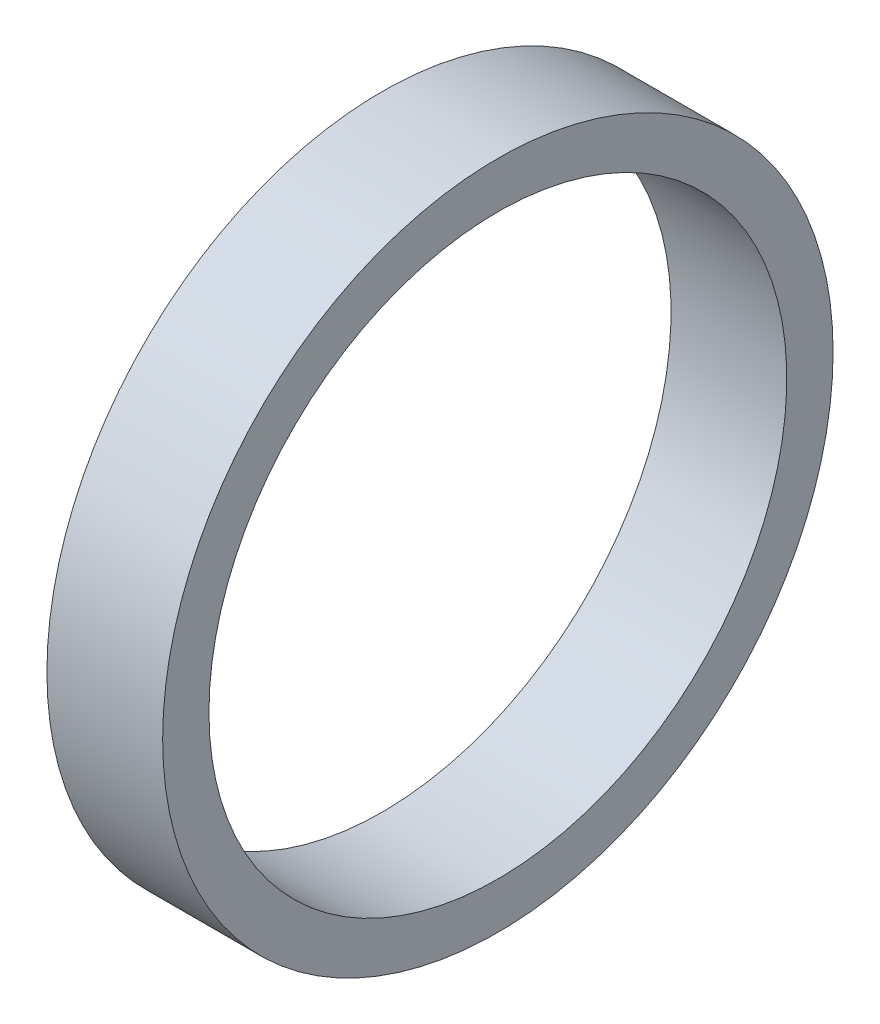
ISO-10303-21;
HEADER;
FILE_DESCRIPTION(('STEP AP214'),'2;1');
FILE_NAME('part.step','',(''),(''),'','','');
FILE_SCHEMA(('AUTOMOTIVE_DESIGN { 1 0 10303 214 1 1 1 1 }'));
ENDSEC;
DATA;
#1=APPLICATION_CONTEXT('core data for automotive mechanical design processes');
#2=APPLICATION_PROTOCOL_DEFINITION('international standard','automotive_design',2000,#1);
#3=PRODUCT_CONTEXT('',#1,'mechanical');
#4=PRODUCT('Part','Part','',(#3));
#5=PRODUCT_RELATED_PRODUCT_CATEGORY('part','',(#4));
#6=PRODUCT_DEFINITION_FORMATION('','',#4);
#7=PRODUCT_DEFINITION_CONTEXT('part definition',#1,'design');
#8=PRODUCT_DEFINITION('design','',#6,#7);
#9=PRODUCT_DEFINITION_SHAPE('','',#8);
#10=(LENGTH_UNIT() NAMED_UNIT(*) SI_UNIT(.MILLI.,.METRE.));
#11=(NAMED_UNIT(*) PLANE_ANGLE_UNIT() SI_UNIT($,.RADIAN.));
#12=(NAMED_UNIT(*) SI_UNIT($,.STERADIAN.) SOLID_ANGLE_UNIT());
#13=UNCERTAINTY_MEASURE_WITH_UNIT(LENGTH_MEASURE(1.E-05),#10,'distance_accuracy_value','');
#14=(GEOMETRIC_REPRESENTATION_CONTEXT(3) GLOBAL_UNCERTAINTY_ASSIGNED_CONTEXT((#13)) GLOBAL_UNIT_ASSIGNED_CONTEXT((#10,
#11,#12)) REPRESENTATION_CONTEXT('',''));
#15=CARTESIAN_POINT('',(0.,0.,0.));
#16=DIRECTION('',(0.,0.,1.));
#17=DIRECTION('',(1.,0.,0.));
#18=AXIS2_PLACEMENT_3D('',#15,#16,#17);
#19=CARTESIAN_POINT('',(14.375,0.,0.));
#20=DIRECTION('',(1.,0.,0.));
#21=DIRECTION('',(0.,0.,-1.));
#22=AXIS2_PLACEMENT_3D('',#19,#20,#21);
#23=PLANE('',#22);
#24=CARTESIAN_POINT('',(14.375,0.,0.));
#25=DIRECTION('',(1.,0.,0.));
#26=DIRECTION('',(0.,0.,-1.));
#27=AXIS2_PLACEMENT_3D('',#24,#25,#26);
#28=CIRCLE('',#27,9.775);
#29=CARTESIAN_POINT('',(14.375,0.,-9.775));
#30=VERTEX_POINT('',#29);
#31=EDGE_CURVE('E11',#30,#30,#28,.T.);
#32=ORIENTED_EDGE('',*,*,#31,.T.);
#33=EDGE_LOOP('',(#32));
#34=FACE_BOUND('',#33,.T.);
#35=CARTESIAN_POINT('',(14.375,0.,0.));
#36=DIRECTION('',(-1.,0.,0.));
#37=DIRECTION('',(0.,0.,-1.));
#38=AXIS2_PLACEMENT_3D('',#35,#36,#37);
#39=CIRCLE('',#38,8.425);
#40=CARTESIAN_POINT('',(14.375,0.,8.425));
#41=VERTEX_POINT('',#40);
#42=EDGE_CURVE('E20',#41,#41,#39,.T.);
#43=ORIENTED_EDGE('',*,*,#42,.T.);
#44=EDGE_LOOP('',(#43));
#45=FACE_BOUND('',#44,.T.);
#46=ADVANCED_FACE('F16',(#34,#45),#23,.T.);
#47=CARTESIAN_POINT('',(11.,0.,0.));
#48=DIRECTION('',(-1.,0.,0.));
#49=DIRECTION('',(0.,0.,1.));
#50=AXIS2_PLACEMENT_3D('',#47,#48,#49);
#51=PLANE('',#50);
#52=CARTESIAN_POINT('',(11.,0.,0.));
#53=DIRECTION('',(-1.,0.,0.));
#54=DIRECTION('',(0.,0.,-1.));
#55=AXIS2_PLACEMENT_3D('',#52,#53,#54);
#56=CIRCLE('',#55,9.775);
#57=CARTESIAN_POINT('',(11.,0.,-9.775));
#58=VERTEX_POINT('',#57);
#59=EDGE_CURVE('E25',#58,#58,#56,.T.);
#60=ORIENTED_EDGE('',*,*,#59,.T.);
#61=EDGE_LOOP('',(#60));
#62=FACE_BOUND('',#61,.T.);
#63=CARTESIAN_POINT('',(11.,0.,0.));
#64=DIRECTION('',(1.,0.,0.));
#65=DIRECTION('',(0.,0.,-1.));
#66=AXIS2_PLACEMENT_3D('',#63,#64,#65);
#67=CIRCLE('',#66,8.425);
#68=CARTESIAN_POINT('',(11.,0.,8.425));
#69=VERTEX_POINT('',#68);
#70=EDGE_CURVE('E42',#69,#69,#67,.T.);
#71=ORIENTED_EDGE('',*,*,#70,.T.);
#72=EDGE_LOOP('',(#71));
#73=FACE_BOUND('',#72,.T.);
#74=ADVANCED_FACE('F46',(#62,#73),#51,.T.);
#75=CARTESIAN_POINT('',(12.6875,0.,0.));
#76=DIRECTION('',(-1.,0.,0.));
#77=DIRECTION('',(0.,0.,-1.));
#78=AXIS2_PLACEMENT_3D('',#75,#76,#77);
#79=CYLINDRICAL_SURFACE('',#78,9.775);
#80=ORIENTED_EDGE('',*,*,#31,.F.);
#81=EDGE_LOOP('',(#80));
#82=FACE_BOUND('',#81,.T.);
#83=ORIENTED_EDGE('',*,*,#59,.F.);
#84=EDGE_LOOP('',(#83));
#85=FACE_BOUND('',#84,.T.);
#86=ADVANCED_FACE('F18',(#82,#85),#79,.T.);
#87=CARTESIAN_POINT('',(12.6875,0.,0.));
#88=DIRECTION('',(-1.,0.,0.));
#89=DIRECTION('',(0.,0.,-1.));
#90=AXIS2_PLACEMENT_3D('',#87,#88,#89);
#91=CYLINDRICAL_SURFACE('',#90,8.425);
#92=ORIENTED_EDGE('',*,*,#70,.F.);
#93=EDGE_LOOP('',(#92));
#94=FACE_BOUND('',#93,.T.);
#95=ORIENTED_EDGE('',*,*,#42,.F.);
#96=EDGE_LOOP('',(#95));
#97=FACE_BOUND('',#96,.T.);
#98=ADVANCED_FACE('F48',(#94,#97),#91,.F.);
#99=CLOSED_SHELL('',(#46,#74,#86,#98));
#100=MANIFOLD_SOLID_BREP('B1',#99);
#101=ADVANCED_BREP_SHAPE_REPRESENTATION('',(#18,#100),#14);
#102=SHAPE_DEFINITION_REPRESENTATION(#9,#101);
ENDSEC;
END-ISO-10303-21;
